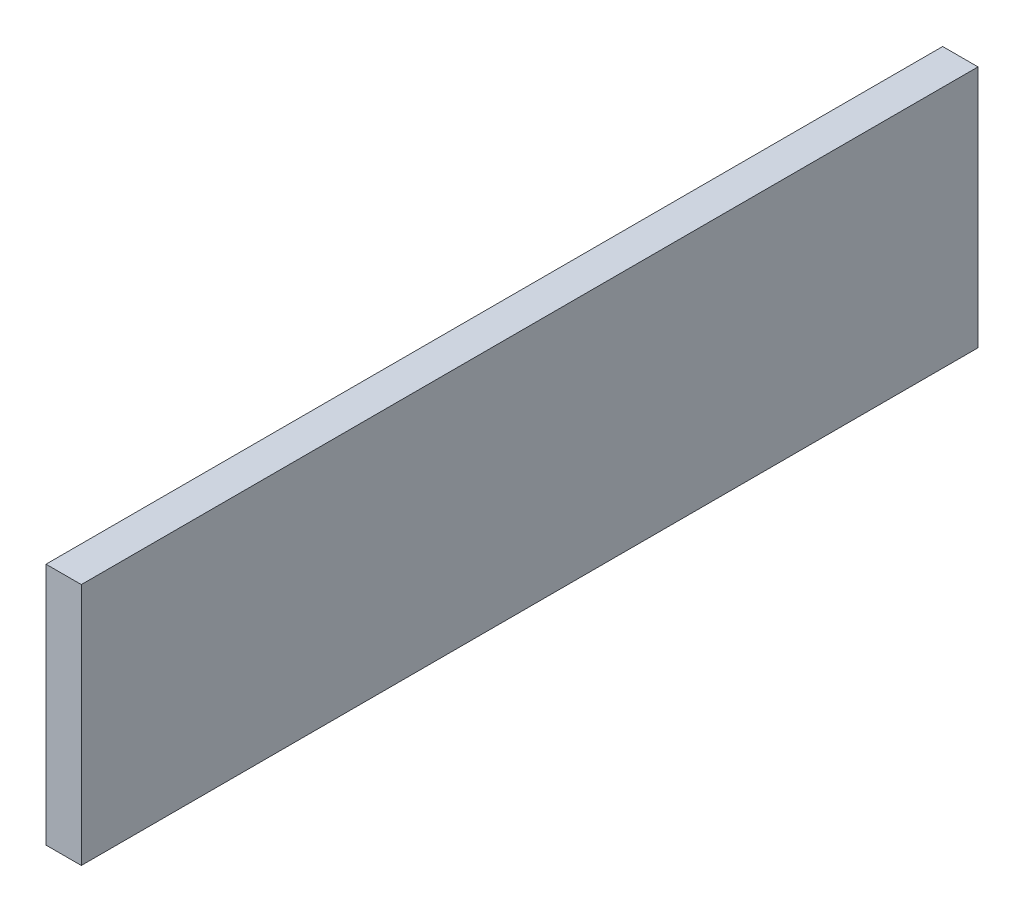
ISO-10303-21;
HEADER;
FILE_DESCRIPTION(('STEP AP214'),'2;1');
FILE_NAME('part.step','',(''),(''),'','','');
FILE_SCHEMA(('AUTOMOTIVE_DESIGN { 1 0 10303 214 1 1 1 1 }'));
ENDSEC;
DATA;
#1=APPLICATION_CONTEXT('core data for automotive mechanical design processes');
#2=APPLICATION_PROTOCOL_DEFINITION('international standard','automotive_design',2000,#1);
#3=PRODUCT_CONTEXT('',#1,'mechanical');
#4=PRODUCT('Part','Part','',(#3));
#5=PRODUCT_RELATED_PRODUCT_CATEGORY('part','',(#4));
#6=PRODUCT_DEFINITION_FORMATION('','',#4);
#7=PRODUCT_DEFINITION_CONTEXT('part definition',#1,'design');
#8=PRODUCT_DEFINITION('design','',#6,#7);
#9=PRODUCT_DEFINITION_SHAPE('','',#8);
#10=(LENGTH_UNIT() NAMED_UNIT(*) SI_UNIT(.MILLI.,.METRE.));
#11=(NAMED_UNIT(*) PLANE_ANGLE_UNIT() SI_UNIT($,.RADIAN.));
#12=(NAMED_UNIT(*) SI_UNIT($,.STERADIAN.) SOLID_ANGLE_UNIT());
#13=UNCERTAINTY_MEASURE_WITH_UNIT(LENGTH_MEASURE(1.E-05),#10,'distance_accuracy_value','');
#14=(GEOMETRIC_REPRESENTATION_CONTEXT(3) GLOBAL_UNCERTAINTY_ASSIGNED_CONTEXT((#13)) GLOBAL_UNIT_ASSIGNED_CONTEXT((#10,
#11,#12)) REPRESENTATION_CONTEXT('',''));
#15=CARTESIAN_POINT('',(0.,0.,0.));
#16=DIRECTION('',(0.,0.,1.));
#17=DIRECTION('',(1.,0.,0.));
#18=AXIS2_PLACEMENT_3D('',#15,#16,#17);
#19=CARTESIAN_POINT('',(18.,-20.2685833730609,-411.395687410613));
#20=DIRECTION('',(0.,0.,1.));
#21=DIRECTION('',(1.,0.,0.));
#22=AXIS2_PLACEMENT_3D('',#19,#20,#21);
#23=PLANE('',#22);
#24=DIRECTION('',(0.,1.,0.));
#25=VECTOR('',#24,1.);
#26=CARTESIAN_POINT('',(0.,-20.2685833730609,-411.395687410613));
#27=LINE('',#26,#25);
#28=CARTESIAN_POINT('',(0.,-20.2685833730609,-411.395687410613));
#29=VERTEX_POINT('',#28);
#30=CARTESIAN_POINT('',(0.,103.731416626939,-411.395687410613));
#31=VERTEX_POINT('',#30);
#32=EDGE_CURVE('E98',#29,#31,#27,.T.);
#33=ORIENTED_EDGE('',*,*,#32,.T.);
#34=DIRECTION('',(-1.,0.,0.));
#35=VECTOR('',#34,1.);
#36=CARTESIAN_POINT('',(18.,103.731416626939,-411.395687410613));
#37=LINE('',#36,#35);
#38=CARTESIAN_POINT('',(18.,103.731416626939,-411.395687410613));
#39=VERTEX_POINT('',#38);
#40=EDGE_CURVE('E11',#39,#31,#37,.T.);
#41=ORIENTED_EDGE('',*,*,#40,.F.);
#42=DIRECTION('',(0.,1.,0.));
#43=VECTOR('',#42,1.);
#44=CARTESIAN_POINT('',(18.,-20.2685833730609,-411.395687410613));
#45=LINE('',#44,#43);
#46=CARTESIAN_POINT('',(18.,-20.2685833730609,-411.395687410613));
#47=VERTEX_POINT('',#46);
#48=EDGE_CURVE('E86',#47,#39,#45,.T.);
#49=ORIENTED_EDGE('',*,*,#48,.F.);
#50=DIRECTION('',(-1.,0.,0.));
#51=VECTOR('',#50,1.);
#52=CARTESIAN_POINT('',(18.,-20.2685833730609,-411.395687410613));
#53=LINE('',#52,#51);
#54=EDGE_CURVE('E94',#47,#29,#53,.T.);
#55=ORIENTED_EDGE('',*,*,#54,.T.);
#56=EDGE_LOOP('',(#33,#41,#49,#55));
#57=FACE_BOUND('',#56,.T.);
#58=ADVANCED_FACE('F35',(#57),#23,.F.);
#59=CARTESIAN_POINT('',(18.,103.731416626939,-411.395687410613));
#60=DIRECTION('',(0.,-1.,0.));
#61=DIRECTION('',(0.,0.,-1.));
#62=AXIS2_PLACEMENT_3D('',#59,#60,#61);
#63=PLANE('',#62);
#64=DIRECTION('',(0.,0.,1.));
#65=VECTOR('',#64,1.);
#66=CARTESIAN_POINT('',(0.,103.731416626939,-411.395687410613));
#67=LINE('',#66,#65);
#68=CARTESIAN_POINT('',(0.,103.731416626939,45.6043125893872));
#69=VERTEX_POINT('',#68);
#70=EDGE_CURVE('E90',#31,#69,#67,.T.);
#71=ORIENTED_EDGE('',*,*,#70,.T.);
#72=DIRECTION('',(-1.,0.,0.));
#73=VECTOR('',#72,1.);
#74=CARTESIAN_POINT('',(18.,103.731416626939,45.6043125893872));
#75=LINE('',#74,#73);
#76=CARTESIAN_POINT('',(18.,103.731416626939,45.6043125893872));
#77=VERTEX_POINT('',#76);
#78=EDGE_CURVE('E43',#77,#69,#75,.T.);
#79=ORIENTED_EDGE('',*,*,#78,.F.);
#80=DIRECTION('',(0.,0.,1.));
#81=VECTOR('',#80,1.);
#82=CARTESIAN_POINT('',(18.,103.731416626939,-411.395687410613));
#83=LINE('',#82,#81);
#84=EDGE_CURVE('E81',#39,#77,#83,.T.);
#85=ORIENTED_EDGE('',*,*,#84,.F.);
#86=ORIENTED_EDGE('',*,*,#40,.T.);
#87=EDGE_LOOP('',(#71,#79,#85,#86));
#88=FACE_BOUND('',#87,.T.);
#89=ADVANCED_FACE('F89',(#88),#63,.F.);
#90=CARTESIAN_POINT('',(18.,-20.268583373061,45.6043125893872));
#91=DIRECTION('',(0.,0.,-1.));
#92=DIRECTION('',(-1.,0.,0.));
#93=AXIS2_PLACEMENT_3D('',#90,#91,#92);
#94=PLANE('',#93);
#95=DIRECTION('',(0.,-1.,0.));
#96=VECTOR('',#95,1.);
#97=CARTESIAN_POINT('',(0.,-20.268583373061,45.6043125893872));
#98=LINE('',#97,#96);
#99=CARTESIAN_POINT('',(0.,-20.268583373061,45.6043125893872));
#100=VERTEX_POINT('',#99);
#101=EDGE_CURVE('E68',#69,#100,#98,.T.);
#102=ORIENTED_EDGE('',*,*,#101,.T.);
#103=DIRECTION('',(-1.,0.,0.));
#104=VECTOR('',#103,1.);
#105=CARTESIAN_POINT('',(18.,-20.268583373061,45.6043125893872));
#106=LINE('',#105,#104);
#107=CARTESIAN_POINT('',(18.,-20.268583373061,45.6043125893872));
#108=VERTEX_POINT('',#107);
#109=EDGE_CURVE('E91',#108,#100,#106,.T.);
#110=ORIENTED_EDGE('',*,*,#109,.F.);
#111=DIRECTION('',(0.,-1.,0.));
#112=VECTOR('',#111,1.);
#113=CARTESIAN_POINT('',(18.,-20.268583373061,45.6043125893872));
#114=LINE('',#113,#112);
#115=EDGE_CURVE('E84',#77,#108,#114,.T.);
#116=ORIENTED_EDGE('',*,*,#115,.F.);
#117=ORIENTED_EDGE('',*,*,#78,.T.);
#118=EDGE_LOOP('',(#102,#110,#116,#117));
#119=FACE_BOUND('',#118,.T.);
#120=ADVANCED_FACE('F92',(#119),#94,.F.);
#121=CARTESIAN_POINT('',(18.,-20.2685833730609,-411.395687410613));
#122=DIRECTION('',(0.,1.,0.));
#123=DIRECTION('',(0.,0.,1.));
#124=AXIS2_PLACEMENT_3D('',#121,#122,#123);
#125=PLANE('',#124);
#126=DIRECTION('',(0.,0.,-1.));
#127=VECTOR('',#126,1.);
#128=CARTESIAN_POINT('',(0.,-20.2685833730609,-411.395687410613));
#129=LINE('',#128,#127);
#130=EDGE_CURVE('E74',#100,#29,#129,.T.);
#131=ORIENTED_EDGE('',*,*,#130,.T.);
#132=ORIENTED_EDGE('',*,*,#54,.F.);
#133=DIRECTION('',(0.,0.,-1.));
#134=VECTOR('',#133,1.);
#135=CARTESIAN_POINT('',(18.,-20.2685833730609,-411.395687410613));
#136=LINE('',#135,#134);
#137=EDGE_CURVE('E51',#108,#47,#136,.T.);
#138=ORIENTED_EDGE('',*,*,#137,.F.);
#139=ORIENTED_EDGE('',*,*,#109,.T.);
#140=EDGE_LOOP('',(#131,#132,#138,#139));
#141=FACE_BOUND('',#140,.T.);
#142=ADVANCED_FACE('F105',(#141),#125,.F.);
#143=CARTESIAN_POINT('',(18.,0.,0.));
#144=DIRECTION('',(1.,0.,0.));
#145=DIRECTION('',(0.,0.,-1.));
#146=AXIS2_PLACEMENT_3D('',#143,#144,#145);
#147=PLANE('',#146);
#148=ORIENTED_EDGE('',*,*,#48,.T.);
#149=ORIENTED_EDGE('',*,*,#84,.T.);
#150=ORIENTED_EDGE('',*,*,#115,.T.);
#151=ORIENTED_EDGE('',*,*,#137,.T.);
#152=EDGE_LOOP('',(#148,#149,#150,#151));
#153=FACE_BOUND('',#152,.T.);
#154=ADVANCED_FACE('F82',(#153),#147,.T.);
#155=CARTESIAN_POINT('',(0.,0.,0.));
#156=DIRECTION('',(1.,0.,0.));
#157=DIRECTION('',(0.,0.,-1.));
#158=AXIS2_PLACEMENT_3D('',#155,#156,#157);
#159=PLANE('',#158);
#160=ORIENTED_EDGE('',*,*,#32,.F.);
#161=ORIENTED_EDGE('',*,*,#130,.F.);
#162=ORIENTED_EDGE('',*,*,#101,.F.);
#163=ORIENTED_EDGE('',*,*,#70,.F.);
#164=EDGE_LOOP('',(#160,#161,#162,#163));
#165=FACE_BOUND('',#164,.T.);
#166=ADVANCED_FACE('F108',(#165),#159,.F.);
#167=CLOSED_SHELL('',(#58,#89,#120,#142,#154,#166));
#168=MANIFOLD_SOLID_BREP('B2',#167);
#169=ADVANCED_BREP_SHAPE_REPRESENTATION('',(#18,#168),#14);
#170=SHAPE_DEFINITION_REPRESENTATION(#9,#169);
ENDSEC;
END-ISO-10303-21;
